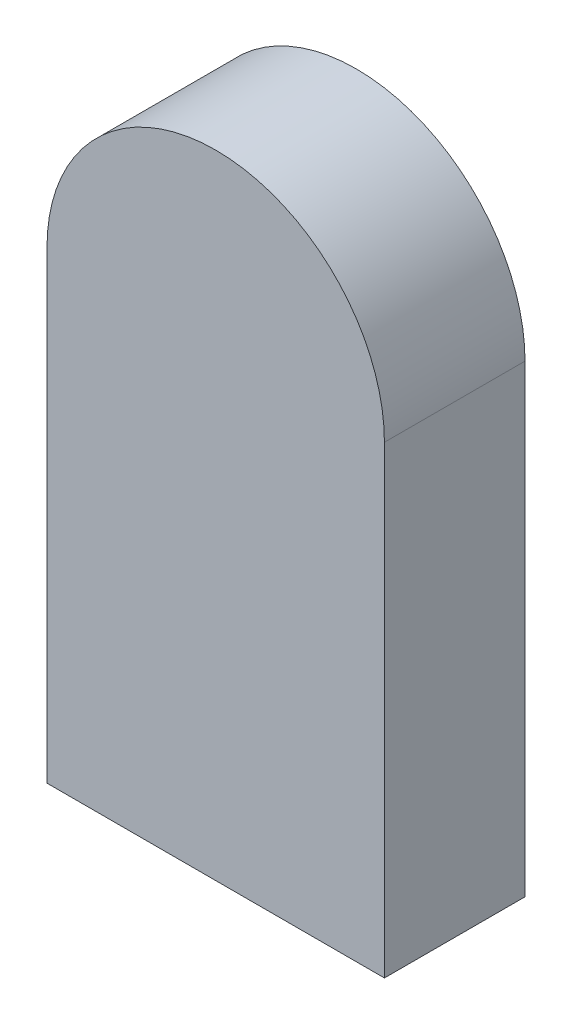
ISO-10303-21;
HEADER;
FILE_DESCRIPTION(('STEP AP214'),'2;1');
FILE_NAME('part.step','',(''),(''),'','','');
FILE_SCHEMA(('AUTOMOTIVE_DESIGN { 1 0 10303 214 1 1 1 1 }'));
ENDSEC;
DATA;
#1=APPLICATION_CONTEXT('core data for automotive mechanical design processes');
#2=APPLICATION_PROTOCOL_DEFINITION('international standard','automotive_design',2000,#1);
#3=PRODUCT_CONTEXT('',#1,'mechanical');
#4=PRODUCT('Part','Part','',(#3));
#5=PRODUCT_RELATED_PRODUCT_CATEGORY('part','',(#4));
#6=PRODUCT_DEFINITION_FORMATION('','',#4);
#7=PRODUCT_DEFINITION_CONTEXT('part definition',#1,'design');
#8=PRODUCT_DEFINITION('design','',#6,#7);
#9=PRODUCT_DEFINITION_SHAPE('','',#8);
#10=(LENGTH_UNIT() NAMED_UNIT(*) SI_UNIT(.MILLI.,.METRE.));
#11=(NAMED_UNIT(*) PLANE_ANGLE_UNIT() SI_UNIT($,.RADIAN.));
#12=(NAMED_UNIT(*) SI_UNIT($,.STERADIAN.) SOLID_ANGLE_UNIT());
#13=UNCERTAINTY_MEASURE_WITH_UNIT(LENGTH_MEASURE(1.E-05),#10,'distance_accuracy_value','');
#14=(GEOMETRIC_REPRESENTATION_CONTEXT(3) GLOBAL_UNCERTAINTY_ASSIGNED_CONTEXT((#13)) GLOBAL_UNIT_ASSIGNED_CONTEXT((#10,
#11,#12)) REPRESENTATION_CONTEXT('',''));
#15=CARTESIAN_POINT('',(0.,0.,0.));
#16=DIRECTION('',(0.,0.,1.));
#17=DIRECTION('',(1.,0.,0.));
#18=AXIS2_PLACEMENT_3D('',#15,#16,#17);
#19=CARTESIAN_POINT('',(0.13,-4.05,0.));
#20=DIRECTION('',(0.,1.,0.));
#21=DIRECTION('',(1.,0.,0.));
#22=AXIS2_PLACEMENT_3D('',#19,#20,#21);
#23=PLANE('',#22);
#24=DIRECTION('',(1.,0.,0.));
#25=VECTOR('',#24,1.);
#26=CARTESIAN_POINT('',(0.13,-4.05,0.));
#27=LINE('',#26,#25);
#28=CARTESIAN_POINT('',(0.13,-4.05,0.));
#29=VERTEX_POINT('',#28);
#30=CARTESIAN_POINT('',(0.37,-4.05,0.));
#31=VERTEX_POINT('',#30);
#32=EDGE_CURVE('E11',#29,#31,#27,.T.);
#33=ORIENTED_EDGE('',*,*,#32,.T.);
#34=DIRECTION('',(0.,0.,1.));
#35=VECTOR('',#34,1.);
#36=CARTESIAN_POINT('',(0.37,-4.05,0.));
#37=LINE('',#36,#35);
#38=CARTESIAN_POINT('',(0.37,-4.05,0.1));
#39=VERTEX_POINT('',#38);
#40=EDGE_CURVE('E24',#31,#39,#37,.T.);
#41=ORIENTED_EDGE('',*,*,#40,.T.);
#42=DIRECTION('',(1.,0.,0.));
#43=VECTOR('',#42,1.);
#44=CARTESIAN_POINT('',(0.13,-4.05,0.1));
#45=LINE('',#44,#43);
#46=CARTESIAN_POINT('',(0.13,-4.05,0.1));
#47=VERTEX_POINT('',#46);
#48=EDGE_CURVE('E87',#47,#39,#45,.T.);
#49=ORIENTED_EDGE('',*,*,#48,.F.);
#50=DIRECTION('',(0.,0.,1.));
#51=VECTOR('',#50,1.);
#52=CARTESIAN_POINT('',(0.13,-4.05,0.));
#53=LINE('',#52,#51);
#54=EDGE_CURVE('E36',#29,#47,#53,.T.);
#55=ORIENTED_EDGE('',*,*,#54,.F.);
#56=EDGE_LOOP('',(#33,#41,#49,#55));
#57=FACE_BOUND('',#56,.T.);
#58=ADVANCED_FACE('F17',(#57),#23,.F.);
#59=CARTESIAN_POINT('',(0.37,-4.05,0.));
#60=DIRECTION('',(-1.,0.,0.));
#61=DIRECTION('',(0.,1.,0.));
#62=AXIS2_PLACEMENT_3D('',#59,#60,#61);
#63=PLANE('',#62);
#64=DIRECTION('',(0.,1.,0.));
#65=VECTOR('',#64,1.);
#66=CARTESIAN_POINT('',(0.37,-4.05,0.));
#67=LINE('',#66,#65);
#68=CARTESIAN_POINT('',(0.37,-3.72,0.));
#69=VERTEX_POINT('',#68);
#70=EDGE_CURVE('E84',#31,#69,#67,.T.);
#71=ORIENTED_EDGE('',*,*,#70,.T.);
#72=DIRECTION('',(0.,0.,1.));
#73=VECTOR('',#72,1.);
#74=CARTESIAN_POINT('',(0.37,-3.72,0.));
#75=LINE('',#74,#73);
#76=CARTESIAN_POINT('',(0.37,-3.72,0.1));
#77=VERTEX_POINT('',#76);
#78=EDGE_CURVE('E82',#69,#77,#75,.T.);
#79=ORIENTED_EDGE('',*,*,#78,.T.);
#80=DIRECTION('',(0.,1.,0.));
#81=VECTOR('',#80,1.);
#82=CARTESIAN_POINT('',(0.37,-4.05,0.1));
#83=LINE('',#82,#81);
#84=EDGE_CURVE('E72',#39,#77,#83,.T.);
#85=ORIENTED_EDGE('',*,*,#84,.F.);
#86=ORIENTED_EDGE('',*,*,#40,.F.);
#87=EDGE_LOOP('',(#71,#79,#85,#86));
#88=FACE_BOUND('',#87,.T.);
#89=ADVANCED_FACE('F89',(#88),#63,.F.);
#90=CARTESIAN_POINT('',(0.25,-3.72,0.));
#91=DIRECTION('',(0.,0.,-1.));
#92=DIRECTION('',(1.,0.,0.));
#93=AXIS2_PLACEMENT_3D('',#90,#91,#92);
#94=CYLINDRICAL_SURFACE('',#93,0.12);
#95=CARTESIAN_POINT('',(0.25,-3.72,0.));
#96=DIRECTION('',(0.,0.,1.));
#97=DIRECTION('',(1.,0.,0.));
#98=AXIS2_PLACEMENT_3D('',#95,#96,#97);
#99=CIRCLE('',#98,0.12);
#100=CARTESIAN_POINT('',(0.13,-3.72,0.));
#101=VERTEX_POINT('',#100);
#102=EDGE_CURVE('E62',#69,#101,#99,.T.);
#103=ORIENTED_EDGE('',*,*,#102,.T.);
#104=DIRECTION('',(0.,0.,1.));
#105=VECTOR('',#104,1.);
#106=CARTESIAN_POINT('',(0.13,-3.72,0.));
#107=LINE('',#106,#105);
#108=CARTESIAN_POINT('',(0.13,-3.72,0.1));
#109=VERTEX_POINT('',#108);
#110=EDGE_CURVE('E57',#101,#109,#107,.T.);
#111=ORIENTED_EDGE('',*,*,#110,.T.);
#112=CARTESIAN_POINT('',(0.25,-3.72,0.1));
#113=DIRECTION('',(0.,0.,1.));
#114=DIRECTION('',(1.,0.,0.));
#115=AXIS2_PLACEMENT_3D('',#112,#113,#114);
#116=CIRCLE('',#115,0.12);
#117=EDGE_CURVE('E60',#77,#109,#116,.T.);
#118=ORIENTED_EDGE('',*,*,#117,.F.);
#119=ORIENTED_EDGE('',*,*,#78,.F.);
#120=EDGE_LOOP('',(#103,#111,#118,#119));
#121=FACE_BOUND('',#120,.T.);
#122=ADVANCED_FACE('F59',(#121),#94,.T.);
#123=CARTESIAN_POINT('',(0.13,-4.05,0.));
#124=DIRECTION('',(-1.,0.,0.));
#125=DIRECTION('',(0.,1.,0.));
#126=AXIS2_PLACEMENT_3D('',#123,#124,#125);
#127=PLANE('',#126);
#128=ORIENTED_EDGE('',*,*,#54,.T.);
#129=DIRECTION('',(0.,1.,0.));
#130=VECTOR('',#129,1.);
#131=CARTESIAN_POINT('',(0.13,-4.05,0.1));
#132=LINE('',#131,#130);
#133=EDGE_CURVE('E71',#47,#109,#132,.T.);
#134=ORIENTED_EDGE('',*,*,#133,.T.);
#135=ORIENTED_EDGE('',*,*,#110,.F.);
#136=DIRECTION('',(0.,1.,0.));
#137=VECTOR('',#136,1.);
#138=CARTESIAN_POINT('',(0.13,-4.05,0.));
#139=LINE('',#138,#137);
#140=EDGE_CURVE('E76',#29,#101,#139,.T.);
#141=ORIENTED_EDGE('',*,*,#140,.F.);
#142=EDGE_LOOP('',(#128,#134,#135,#141));
#143=FACE_BOUND('',#142,.T.);
#144=ADVANCED_FACE('F75',(#143),#127,.T.);
#145=CARTESIAN_POINT('',(0.25,-3.849490847913,0.));
#146=DIRECTION('',(0.,0.,1.));
#147=DIRECTION('',(1.,0.,0.));
#148=AXIS2_PLACEMENT_3D('',#145,#146,#147);
#149=PLANE('',#148);
#150=ORIENTED_EDGE('',*,*,#140,.T.);
#151=ORIENTED_EDGE('',*,*,#102,.F.);
#152=ORIENTED_EDGE('',*,*,#70,.F.);
#153=ORIENTED_EDGE('',*,*,#32,.F.);
#154=EDGE_LOOP('',(#150,#151,#152,#153));
#155=FACE_BOUND('',#154,.T.);
#156=ADVANCED_FACE('F91',(#155),#149,.F.);
#157=CARTESIAN_POINT('',(0.25,-3.849490847913,0.1));
#158=DIRECTION('',(0.,0.,1.));
#159=DIRECTION('',(1.,0.,0.));
#160=AXIS2_PLACEMENT_3D('',#157,#158,#159);
#161=PLANE('',#160);
#162=ORIENTED_EDGE('',*,*,#48,.T.);
#163=ORIENTED_EDGE('',*,*,#84,.T.);
#164=ORIENTED_EDGE('',*,*,#117,.T.);
#165=ORIENTED_EDGE('',*,*,#133,.F.);
#166=EDGE_LOOP('',(#162,#163,#164,#165));
#167=FACE_BOUND('',#166,.T.);
#168=ADVANCED_FACE('F70',(#167),#161,.T.);
#169=CLOSED_SHELL('',(#58,#89,#122,#144,#156,#168));
#170=MANIFOLD_SOLID_BREP('B1',#169);
#171=ADVANCED_BREP_SHAPE_REPRESENTATION('',(#18,#170),#14);
#172=SHAPE_DEFINITION_REPRESENTATION(#9,#171);
ENDSEC;
END-ISO-10303-21;
